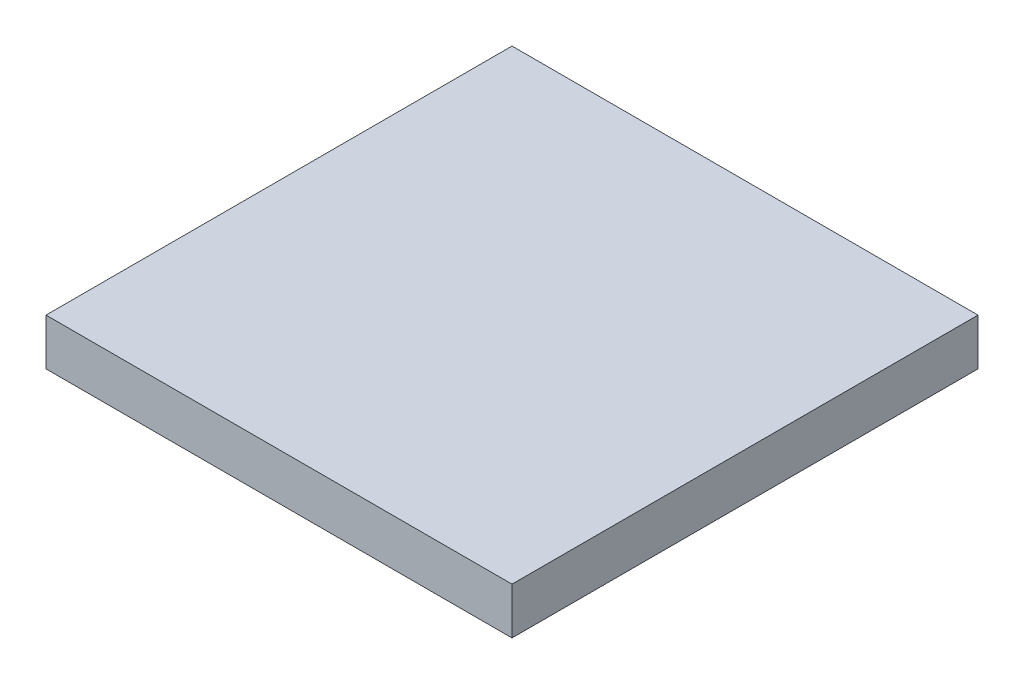
ISO-10303-21;
HEADER;
FILE_DESCRIPTION(('STEP AP214'),'2;1');
FILE_NAME('part.step','',(''),(''),'','','');
FILE_SCHEMA(('AUTOMOTIVE_DESIGN { 1 0 10303 214 1 1 1 1 }'));
ENDSEC;
DATA;
#1=APPLICATION_CONTEXT('core data for automotive mechanical design processes');
#2=APPLICATION_PROTOCOL_DEFINITION('international standard','automotive_design',2000,#1);
#3=PRODUCT_CONTEXT('',#1,'mechanical');
#4=PRODUCT('Part','Part','',(#3));
#5=PRODUCT_RELATED_PRODUCT_CATEGORY('part','',(#4));
#6=PRODUCT_DEFINITION_FORMATION('','',#4);
#7=PRODUCT_DEFINITION_CONTEXT('part definition',#1,'design');
#8=PRODUCT_DEFINITION('design','',#6,#7);
#9=PRODUCT_DEFINITION_SHAPE('','',#8);
#10=(LENGTH_UNIT() NAMED_UNIT(*) SI_UNIT(.MILLI.,.METRE.));
#11=(NAMED_UNIT(*) PLANE_ANGLE_UNIT() SI_UNIT($,.RADIAN.));
#12=(NAMED_UNIT(*) SI_UNIT($,.STERADIAN.) SOLID_ANGLE_UNIT());
#13=UNCERTAINTY_MEASURE_WITH_UNIT(LENGTH_MEASURE(1.E-05),#10,'distance_accuracy_value','');
#14=(GEOMETRIC_REPRESENTATION_CONTEXT(3) GLOBAL_UNCERTAINTY_ASSIGNED_CONTEXT((#13)) GLOBAL_UNIT_ASSIGNED_CONTEXT((#10,
#11,#12)) REPRESENTATION_CONTEXT('',''));
#15=CARTESIAN_POINT('',(0.,0.,0.));
#16=DIRECTION('',(0.,0.,1.));
#17=DIRECTION('',(1.,0.,0.));
#18=AXIS2_PLACEMENT_3D('',#15,#16,#17);
#19=CARTESIAN_POINT('',(-1.00000054,-0.09999980000001,0.));
#20=DIRECTION('',(0.,1.,0.));
#21=DIRECTION('',(0.,0.,1.));
#22=AXIS2_PLACEMENT_3D('',#19,#20,#21);
#23=PLANE('',#22);
#24=DIRECTION('',(0.,0.,1.));
#25=VECTOR('',#24,1.);
#26=CARTESIAN_POINT('',(1.00000054,-0.09999980000001,0.));
#27=LINE('',#26,#25);
#28=CARTESIAN_POINT('',(1.00000054,-0.09999980000001,0.));
#29=VERTEX_POINT('',#28);
#30=CARTESIAN_POINT('',(1.00000054,-0.09999980000001,2.00000108));
#31=VERTEX_POINT('',#30);
#32=EDGE_CURVE('E19',#29,#31,#27,.T.);
#33=ORIENTED_EDGE('',*,*,#32,.T.);
#34=DIRECTION('',(-1.,0.,0.));
#35=VECTOR('',#34,1.);
#36=CARTESIAN_POINT('',(1.00000054,-0.09999980000001,2.00000108));
#37=LINE('',#36,#35);
#38=CARTESIAN_POINT('',(-1.00000054,-0.09999980000001,2.00000108));
#39=VERTEX_POINT('',#38);
#40=EDGE_CURVE('E54',#31,#39,#37,.T.);
#41=ORIENTED_EDGE('',*,*,#40,.T.);
#42=DIRECTION('',(0.,0.,-1.));
#43=VECTOR('',#42,1.);
#44=CARTESIAN_POINT('',(-1.00000054,-0.09999980000001,0.));
#45=LINE('',#44,#43);
#46=CARTESIAN_POINT('',(-1.00000054,-0.09999980000001,0.));
#47=VERTEX_POINT('',#46);
#48=EDGE_CURVE('E75',#39,#47,#45,.T.);
#49=ORIENTED_EDGE('',*,*,#48,.T.);
#50=DIRECTION('',(-1.,0.,0.));
#51=VECTOR('',#50,1.);
#52=CARTESIAN_POINT('',(1.00000054,-0.09999980000001,0.));
#53=LINE('',#52,#51);
#54=EDGE_CURVE('E57',#29,#47,#53,.T.);
#55=ORIENTED_EDGE('',*,*,#54,.F.);
#56=EDGE_LOOP('',(#33,#41,#49,#55));
#57=FACE_BOUND('',#56,.T.);
#58=ADVANCED_FACE('F16',(#57),#23,.F.);
#59=CARTESIAN_POINT('',(1.00000054,-0.09999980000001,0.));
#60=DIRECTION('',(-1.,0.,0.));
#61=DIRECTION('',(0.,0.,1.));
#62=AXIS2_PLACEMENT_3D('',#59,#60,#61);
#63=PLANE('',#62);
#64=DIRECTION('',(0.,0.,-1.));
#65=VECTOR('',#64,1.);
#66=CARTESIAN_POINT('',(1.00000054,0.09999980000001,0.));
#67=LINE('',#66,#65);
#68=CARTESIAN_POINT('',(1.00000054,0.09999980000001,0.));
#69=VERTEX_POINT('',#68);
#70=CARTESIAN_POINT('',(1.00000054,0.09999980000001,2.00000108));
#71=VERTEX_POINT('',#70);
#72=EDGE_CURVE('E72',#69,#71,#67,.F.);
#73=ORIENTED_EDGE('',*,*,#72,.T.);
#74=DIRECTION('',(0.,1.,0.));
#75=VECTOR('',#74,1.);
#76=CARTESIAN_POINT('',(1.00000054,0.09999980000001,2.00000108));
#77=LINE('',#76,#75);
#78=EDGE_CURVE('E62',#71,#31,#77,.F.);
#79=ORIENTED_EDGE('',*,*,#78,.T.);
#80=ORIENTED_EDGE('',*,*,#32,.F.);
#81=DIRECTION('',(0.,1.,0.));
#82=VECTOR('',#81,1.);
#83=CARTESIAN_POINT('',(1.00000054,0.09999980000001,0.));
#84=LINE('',#83,#82);
#85=EDGE_CURVE('E77',#69,#29,#84,.F.);
#86=ORIENTED_EDGE('',*,*,#85,.F.);
#87=EDGE_LOOP('',(#73,#79,#80,#86));
#88=FACE_BOUND('',#87,.T.);
#89=ADVANCED_FACE('F71',(#88),#63,.F.);
#90=CARTESIAN_POINT('',(1.00000054,0.09999980000001,2.00000108));
#91=DIRECTION('',(0.,0.,-1.));
#92=DIRECTION('',(-1.,0.,0.));
#93=AXIS2_PLACEMENT_3D('',#90,#91,#92);
#94=PLANE('',#93);
#95=DIRECTION('',(0.,1.,0.));
#96=VECTOR('',#95,1.);
#97=CARTESIAN_POINT('',(-1.00000054,0.09999980000001,2.00000108));
#98=LINE('',#97,#96);
#99=CARTESIAN_POINT('',(-1.00000054,0.09999980000001,2.00000108));
#100=VERTEX_POINT('',#99);
#101=EDGE_CURVE('E68',#100,#39,#98,.F.);
#102=ORIENTED_EDGE('',*,*,#101,.T.);
#103=ORIENTED_EDGE('',*,*,#40,.F.);
#104=ORIENTED_EDGE('',*,*,#78,.F.);
#105=DIRECTION('',(1.,0.,0.));
#106=VECTOR('',#105,1.);
#107=CARTESIAN_POINT('',(1.00000054,0.09999980000001,2.00000108));
#108=LINE('',#107,#106);
#109=EDGE_CURVE('E82',#71,#100,#108,.F.);
#110=ORIENTED_EDGE('',*,*,#109,.T.);
#111=EDGE_LOOP('',(#102,#103,#104,#110));
#112=FACE_BOUND('',#111,.T.);
#113=ADVANCED_FACE('F65',(#112),#94,.F.);
#114=CARTESIAN_POINT('',(-1.00000054,0.09999980000001,0.));
#115=DIRECTION('',(1.,0.,0.));
#116=DIRECTION('',(0.,0.,-1.));
#117=AXIS2_PLACEMENT_3D('',#114,#115,#116);
#118=PLANE('',#117);
#119=ORIENTED_EDGE('',*,*,#48,.F.);
#120=ORIENTED_EDGE('',*,*,#101,.F.);
#121=DIRECTION('',(0.,0.,-1.));
#122=VECTOR('',#121,1.);
#123=CARTESIAN_POINT('',(-1.00000054,0.09999980000001,0.));
#124=LINE('',#123,#122);
#125=CARTESIAN_POINT('',(-1.00000054,0.09999980000001,0.));
#126=VERTEX_POINT('',#125);
#127=EDGE_CURVE('E25',#100,#126,#124,.T.);
#128=ORIENTED_EDGE('',*,*,#127,.T.);
#129=DIRECTION('',(0.,1.,0.));
#130=VECTOR('',#129,1.);
#131=CARTESIAN_POINT('',(-1.00000054,0.09999980000001,0.));
#132=LINE('',#131,#130);
#133=EDGE_CURVE('E33',#47,#126,#132,.T.);
#134=ORIENTED_EDGE('',*,*,#133,.F.);
#135=EDGE_LOOP('',(#119,#120,#128,#134));
#136=FACE_BOUND('',#135,.T.);
#137=ADVANCED_FACE('F87',(#136),#118,.F.);
#138=CARTESIAN_POINT('',(1.00000054,0.09999980000001,0.));
#139=DIRECTION('',(0.,0.,-1.));
#140=DIRECTION('',(-1.,0.,0.));
#141=AXIS2_PLACEMENT_3D('',#138,#139,#140);
#142=PLANE('',#141);
#143=ORIENTED_EDGE('',*,*,#133,.T.);
#144=DIRECTION('',(1.,0.,0.));
#145=VECTOR('',#144,1.);
#146=CARTESIAN_POINT('',(1.00000054,0.09999980000001,0.));
#147=LINE('',#146,#145);
#148=EDGE_CURVE('E11',#126,#69,#147,.T.);
#149=ORIENTED_EDGE('',*,*,#148,.T.);
#150=ORIENTED_EDGE('',*,*,#85,.T.);
#151=ORIENTED_EDGE('',*,*,#54,.T.);
#152=EDGE_LOOP('',(#143,#149,#150,#151));
#153=FACE_BOUND('',#152,.T.);
#154=ADVANCED_FACE('F90',(#153),#142,.T.);
#155=CARTESIAN_POINT('',(1.00000054,0.09999980000001,0.));
#156=DIRECTION('',(0.,-1.,0.));
#157=DIRECTION('',(0.,0.,-1.));
#158=AXIS2_PLACEMENT_3D('',#155,#156,#157);
#159=PLANE('',#158);
#160=ORIENTED_EDGE('',*,*,#127,.F.);
#161=ORIENTED_EDGE('',*,*,#109,.F.);
#162=ORIENTED_EDGE('',*,*,#72,.F.);
#163=ORIENTED_EDGE('',*,*,#148,.F.);
#164=EDGE_LOOP('',(#160,#161,#162,#163));
#165=FACE_BOUND('',#164,.T.);
#166=ADVANCED_FACE('F89',(#165),#159,.F.);
#167=CLOSED_SHELL('',(#58,#89,#113,#137,#154,#166));
#168=MANIFOLD_SOLID_BREP('B1',#167);
#169=ADVANCED_BREP_SHAPE_REPRESENTATION('',(#18,#168),#14);
#170=SHAPE_DEFINITION_REPRESENTATION(#9,#169);
ENDSEC;
END-ISO-10303-21;
